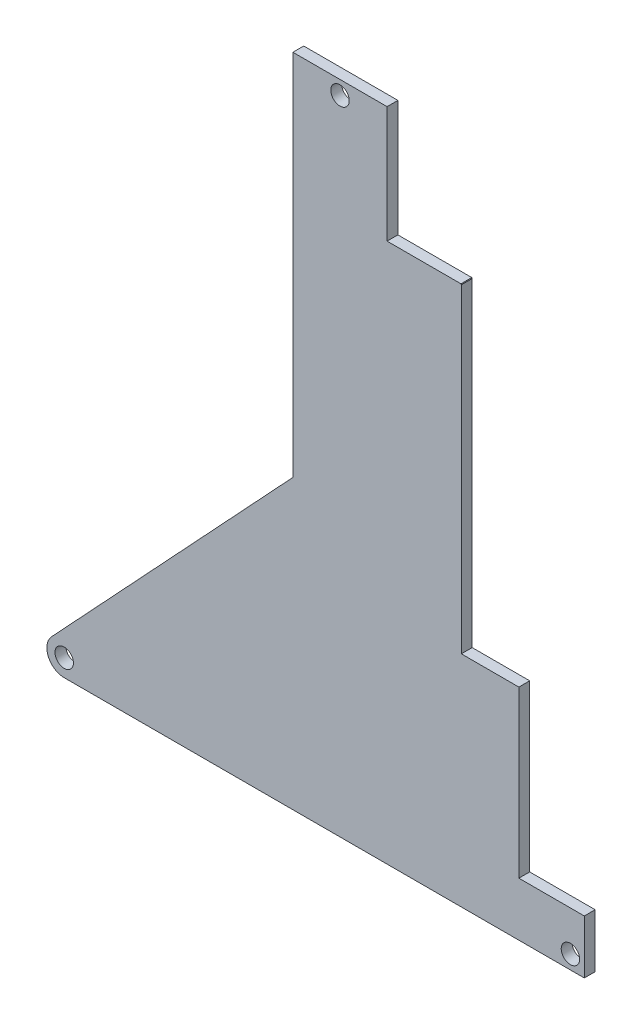
ISO-10303-21;
HEADER;
FILE_DESCRIPTION(('STEP AP214'),'2;1');
FILE_NAME('part.step','',(''),(''),'','','');
FILE_SCHEMA(('AUTOMOTIVE_DESIGN { 1 0 10303 214 1 1 1 1 }'));
ENDSEC;
DATA;
#1=APPLICATION_CONTEXT('core data for automotive mechanical design processes');
#2=APPLICATION_PROTOCOL_DEFINITION('international standard','automotive_design',2000,#1);
#3=PRODUCT_CONTEXT('',#1,'mechanical');
#4=PRODUCT('Part','Part','',(#3));
#5=PRODUCT_RELATED_PRODUCT_CATEGORY('part','',(#4));
#6=PRODUCT_DEFINITION_FORMATION('','',#4);
#7=PRODUCT_DEFINITION_CONTEXT('part definition',#1,'design');
#8=PRODUCT_DEFINITION('design','',#6,#7);
#9=PRODUCT_DEFINITION_SHAPE('','',#8);
#10=(LENGTH_UNIT() NAMED_UNIT(*) SI_UNIT(.MILLI.,.METRE.));
#11=(NAMED_UNIT(*) PLANE_ANGLE_UNIT() SI_UNIT($,.RADIAN.));
#12=(NAMED_UNIT(*) SI_UNIT($,.STERADIAN.) SOLID_ANGLE_UNIT());
#13=UNCERTAINTY_MEASURE_WITH_UNIT(LENGTH_MEASURE(1.E-05),#10,'distance_accuracy_value','');
#14=(GEOMETRIC_REPRESENTATION_CONTEXT(3) GLOBAL_UNCERTAINTY_ASSIGNED_CONTEXT((#13)) GLOBAL_UNIT_ASSIGNED_CONTEXT((#10,
#11,#12)) REPRESENTATION_CONTEXT('',''));
#15=CARTESIAN_POINT('',(0.,0.,0.));
#16=DIRECTION('',(0.,0.,1.));
#17=DIRECTION('',(1.,0.,0.));
#18=AXIS2_PLACEMENT_3D('',#15,#16,#17);
#19=CARTESIAN_POINT('',(-125.358525,-65.3471745152761,1.5875));
#20=DIRECTION('',(0.,0.,-1.));
#21=DIRECTION('',(-1.,0.,0.));
#22=AXIS2_PLACEMENT_3D('',#19,#20,#21);
#23=CYLINDRICAL_SURFACE('',#22,149.225);
#24=DIRECTION('',(0.,0.,-1.));
#25=VECTOR('',#24,1.);
#26=CARTESIAN_POINT('',(5.78929234933584,5.84517500000026,1.58750000000001));
#27=LINE('',#26,#25);
#28=CARTESIAN_POINT('',(5.78929234933584,5.84517500000026,1.58750000000001));
#29=VERTEX_POINT('',#28);
#30=CARTESIAN_POINT('',(5.78929234933584,5.84517500000026,0.));
#31=VERTEX_POINT('',#30);
#32=EDGE_CURVE('E145',#29,#31,#27,.T.);
#33=ORIENTED_EDGE('',*,*,#32,.F.);
#34=CARTESIAN_POINT('',(-125.358525,-65.3471745152761,1.5875));
#35=DIRECTION('',(0.,0.,1.));
#36=DIRECTION('',(1.,0.,0.));
#37=AXIS2_PLACEMENT_3D('',#34,#35,#36);
#38=CIRCLE('',#37,149.225);
#39=CARTESIAN_POINT('',(5.84517499999993,5.74213362110995,1.58750000000002));
#40=VERTEX_POINT('',#39);
#41=EDGE_CURVE('E151',#40,#29,#38,.T.);
#42=ORIENTED_EDGE('',*,*,#41,.F.);
#43=DIRECTION('',(0.,0.,-1.));
#44=VECTOR('',#43,1.);
#45=CARTESIAN_POINT('',(5.84517499999993,5.74213362110995,1.58750000000002));
#46=LINE('',#45,#44);
#47=CARTESIAN_POINT('',(5.84517499999993,5.74213362110995,0.));
#48=VERTEX_POINT('',#47);
#49=EDGE_CURVE('E179',#40,#48,#46,.T.);
#50=ORIENTED_EDGE('',*,*,#49,.T.);
#51=CARTESIAN_POINT('',(-125.358525,-65.3471745152761,0.));
#52=DIRECTION('',(0.,0.,1.));
#53=DIRECTION('',(1.,0.,0.));
#54=AXIS2_PLACEMENT_3D('',#51,#52,#53);
#55=CIRCLE('',#54,149.225);
#56=EDGE_CURVE('E209',#48,#31,#55,.T.);
#57=ORIENTED_EDGE('',*,*,#56,.T.);
#58=EDGE_LOOP('',(#33,#42,#50,#57));
#59=FACE_BOUND('',#58,.T.);
#60=ADVANCED_FACE('F36',(#59),#23,.T.);
#61=CARTESIAN_POINT('',(-125.358525,-65.3471745152761,1.5875));
#62=DIRECTION('',(0.,0.,1.));
#63=DIRECTION('',(1.,0.,0.));
#64=AXIS2_PLACEMENT_3D('',#61,#62,#63);
#65=PLANE('',#64);
#66=CARTESIAN_POINT('',(21.8344750000002,-71.1891745152759,1.5875));
#67=DIRECTION('',(0.,0.,-1.));
#68=DIRECTION('',(-1.,0.,0.));
#69=AXIS2_PLACEMENT_3D('',#66,#67,#68);
#70=CIRCLE('',#69,1.35255);
#71=CARTESIAN_POINT('',(20.4819250000002,-71.1891745152759,1.5875));
#72=VERTEX_POINT('',#71);
#73=EDGE_CURVE('E190',#72,#72,#70,.T.);
#74=ORIENTED_EDGE('',*,*,#73,.T.);
#75=EDGE_LOOP('',(#74));
#76=FACE_BOUND('',#75,.T.);
#77=CARTESIAN_POINT('',(-52.355372399303,-70.6811745152759,1.58750000000002));
#78=DIRECTION('',(0.,0.,-1.));
#79=DIRECTION('',(-1.,0.,0.));
#80=AXIS2_PLACEMENT_3D('',#77,#78,#79);
#81=CIRCLE('',#80,1.35255);
#82=CARTESIAN_POINT('',(-53.707922399303,-70.6811745152759,1.58750000000002));
#83=VERTEX_POINT('',#82);
#84=EDGE_CURVE('E196',#83,#83,#81,.T.);
#85=ORIENTED_EDGE('',*,*,#84,.T.);
#86=EDGE_LOOP('',(#85));
#87=FACE_BOUND('',#86,.T.);
#88=CARTESIAN_POINT('',(-11.9368860457787,20.8858254847239,1.58750000000001));
#89=DIRECTION('',(0.,0.,-1.));
#90=DIRECTION('',(-1.,0.,0.));
#91=AXIS2_PLACEMENT_3D('',#88,#89,#90);
#92=CIRCLE('',#91,1.35255);
#93=CARTESIAN_POINT('',(-13.2894360457787,20.8858254847239,1.58750000000001));
#94=VERTEX_POINT('',#93);
#95=EDGE_CURVE('E202',#94,#94,#92,.T.);
#96=ORIENTED_EDGE('',*,*,#95,.T.);
#97=EDGE_LOOP('',(#96));
#98=FACE_BOUND('',#97,.T.);
#99=ORIENTED_EDGE('',*,*,#41,.T.);
#100=DIRECTION('',(1.,0.,0.));
#101=VECTOR('',#100,1.);
#102=CARTESIAN_POINT('',(0.,5.84517500000026,1.5875));
#103=LINE('',#102,#101);
#104=CARTESIAN_POINT('',(-5.03649709155751,5.84517500000026,1.58750000000002));
#105=VERTEX_POINT('',#104);
#106=EDGE_CURVE('E141',#105,#29,#103,.T.);
#107=ORIENTED_EDGE('',*,*,#106,.F.);
#108=DIRECTION('',(0.,-1.,0.));
#109=VECTOR('',#108,1.);
#110=CARTESIAN_POINT('',(-5.03649709155752,0.,1.5875));
#111=LINE('',#110,#109);
#112=CARTESIAN_POINT('',(-5.03649709155759,22.917825484724,1.58750000000002));
#113=VERTEX_POINT('',#112);
#114=EDGE_CURVE('E131',#113,#105,#111,.T.);
#115=ORIENTED_EDGE('',*,*,#114,.F.);
#116=DIRECTION('',(-1.,0.,0.));
#117=VECTOR('',#116,1.);
#118=CARTESIAN_POINT('',(-18.8372749999999,22.9178254847239,1.58750000000003));
#119=LINE('',#118,#117);
#120=CARTESIAN_POINT('',(-18.8372749999999,22.9178254847239,1.58750000000003));
#121=VERTEX_POINT('',#120);
#122=EDGE_CURVE('E206',#113,#121,#119,.T.);
#123=ORIENTED_EDGE('',*,*,#122,.T.);
#124=DIRECTION('',(0.,-1.,0.));
#125=VECTOR('',#124,1.);
#126=CARTESIAN_POINT('',(-18.8372749999999,22.9178254847239,1.58750000000003));
#127=LINE('',#126,#125);
#128=CARTESIAN_POINT('',(-18.8372749999999,-31.0384526299173,1.58750000000002));
#129=VERTEX_POINT('',#128);
#130=EDGE_CURVE('E208',#121,#129,#127,.T.);
#131=ORIENTED_EDGE('',*,*,#130,.T.);
#132=DIRECTION('',(-0.682242521066146,-0.731125941578678,0.));
#133=VECTOR('',#132,1.);
#134=CARTESIAN_POINT('',(-30.5784249999998,-43.6208688292942,1.58750000000001));
#135=LINE('',#134,#133);
#136=CARTESIAN_POINT('',(-54.2124322909127,-68.9482785117678,1.5875));
#137=VERTEX_POINT('',#136);
#138=EDGE_CURVE('E211',#129,#137,#135,.T.);
#139=ORIENTED_EDGE('',*,*,#138,.T.);
#140=CARTESIAN_POINT('',(-52.355372399303,-70.6811745152759,1.58750000000002));
#141=DIRECTION('',(0.,0.,1.));
#142=DIRECTION('',(-1.,0.,0.));
#143=AXIS2_PLACEMENT_3D('',#140,#141,#142);
#144=CIRCLE('',#143,2.54);
#145=CARTESIAN_POINT('',(-52.3553723993029,-73.2211745152759,1.58750000000002));
#146=VERTEX_POINT('',#145);
#147=EDGE_CURVE('E213',#137,#146,#144,.T.);
#148=ORIENTED_EDGE('',*,*,#147,.T.);
#149=DIRECTION('',(1.,0.,0.));
#150=VECTOR('',#149,1.);
#151=CARTESIAN_POINT('',(-30.5784249999998,-73.2211745152759,1.58750000000001));
#152=LINE('',#151,#150);
#153=CARTESIAN_POINT('',(23.8664750000002,-73.2211745152759,1.58750000000001));
#154=VERTEX_POINT('',#153);
#155=EDGE_CURVE('E215',#146,#154,#152,.T.);
#156=ORIENTED_EDGE('',*,*,#155,.T.);
#157=DIRECTION('',(0.,1.,0.));
#158=VECTOR('',#157,1.);
#159=CARTESIAN_POINT('',(23.8664750000002,-65.3471745152757,1.58750000000002));
#160=LINE('',#159,#158);
#161=CARTESIAN_POINT('',(23.8664750000002,-65.3471745152757,1.58750000000002));
#162=VERTEX_POINT('',#161);
#163=EDGE_CURVE('E217',#154,#162,#160,.T.);
#164=ORIENTED_EDGE('',*,*,#163,.T.);
#165=DIRECTION('',(-1.,0.,0.));
#166=VECTOR('',#165,1.);
#167=CARTESIAN_POINT('',(2.26901830657766E-12,-65.3471745152765,1.5875));
#168=LINE('',#167,#166);
#169=CARTESIAN_POINT('',(14.277975,-65.3471745152761,1.5875));
#170=VERTEX_POINT('',#169);
#171=EDGE_CURVE('E158',#162,#170,#168,.T.);
#172=ORIENTED_EDGE('',*,*,#171,.T.);
#173=DIRECTION('',(0.,1.,0.));
#174=VECTOR('',#173,1.);
#175=CARTESIAN_POINT('',(14.277975,0.,1.5875));
#176=LINE('',#175,#174);
#177=CARTESIAN_POINT('',(14.277975,-41.0901745152762,1.58750000000003));
#178=VERTEX_POINT('',#177);
#179=EDGE_CURVE('E161',#170,#178,#176,.T.);
#180=ORIENTED_EDGE('',*,*,#179,.T.);
#181=DIRECTION('',(1.,0.,0.));
#182=VECTOR('',#181,1.);
#183=CARTESIAN_POINT('',(0.,-41.0901745152762,1.58750000000004));
#184=LINE('',#183,#182);
#185=CARTESIAN_POINT('',(5.84517499999992,-41.0901745152762,1.58750000000002));
#186=VERTEX_POINT('',#185);
#187=EDGE_CURVE('E165',#186,#178,#184,.T.);
#188=ORIENTED_EDGE('',*,*,#187,.F.);
#189=DIRECTION('',(0.,-1.,0.));
#190=VECTOR('',#189,1.);
#191=CARTESIAN_POINT('',(5.84517499999992,0.,1.58750000000001));
#192=LINE('',#191,#190);
#193=EDGE_CURVE('E167',#40,#186,#192,.T.);
#194=ORIENTED_EDGE('',*,*,#193,.F.);
#195=EDGE_LOOP('',(#99,#107,#115,#123,#131,#139,#148,#156,#164,#172,#180,#188,#194));
#196=FACE_BOUND('',#195,.T.);
#197=ADVANCED_FACE('F148',(#76,#87,#98,#196),#65,.T.);
#198=CARTESIAN_POINT('',(-125.358525,-65.3471745152761,0.));
#199=DIRECTION('',(0.,0.,1.));
#200=DIRECTION('',(1.,0.,0.));
#201=AXIS2_PLACEMENT_3D('',#198,#199,#200);
#202=PLANE('',#201);
#203=CARTESIAN_POINT('',(-11.9368860457787,20.8858254847239,0.));
#204=DIRECTION('',(0.,0.,-1.));
#205=DIRECTION('',(-1.,0.,0.));
#206=AXIS2_PLACEMENT_3D('',#203,#204,#205);
#207=CIRCLE('',#206,1.35255);
#208=CARTESIAN_POINT('',(-13.2894360457787,20.8858254847239,0.));
#209=VERTEX_POINT('',#208);
#210=EDGE_CURVE('E199',#209,#209,#207,.T.);
#211=ORIENTED_EDGE('',*,*,#210,.F.);
#212=EDGE_LOOP('',(#211));
#213=FACE_BOUND('',#212,.T.);
#214=CARTESIAN_POINT('',(-52.355372399303,-70.6811745152759,0.));
#215=DIRECTION('',(0.,0.,-1.));
#216=DIRECTION('',(-1.,0.,0.));
#217=AXIS2_PLACEMENT_3D('',#214,#215,#216);
#218=CIRCLE('',#217,1.35255);
#219=CARTESIAN_POINT('',(-53.707922399303,-70.6811745152759,0.));
#220=VERTEX_POINT('',#219);
#221=EDGE_CURVE('E193',#220,#220,#218,.T.);
#222=ORIENTED_EDGE('',*,*,#221,.F.);
#223=EDGE_LOOP('',(#222));
#224=FACE_BOUND('',#223,.T.);
#225=CARTESIAN_POINT('',(21.8344750000002,-71.1891745152759,0.));
#226=DIRECTION('',(0.,0.,-1.));
#227=DIRECTION('',(-1.,0.,0.));
#228=AXIS2_PLACEMENT_3D('',#225,#226,#227);
#229=CIRCLE('',#228,1.35255);
#230=CARTESIAN_POINT('',(20.4819250000002,-71.1891745152759,0.));
#231=VERTEX_POINT('',#230);
#232=EDGE_CURVE('E182',#231,#231,#229,.T.);
#233=ORIENTED_EDGE('',*,*,#232,.F.);
#234=EDGE_LOOP('',(#233));
#235=FACE_BOUND('',#234,.T.);
#236=DIRECTION('',(1.,0.,0.));
#237=VECTOR('',#236,1.);
#238=CARTESIAN_POINT('',(0.,5.84517500000026,0.));
#239=LINE('',#238,#237);
#240=CARTESIAN_POINT('',(-5.03649709155751,5.84517500000026,0.));
#241=VERTEX_POINT('',#240);
#242=EDGE_CURVE('E51',#241,#31,#239,.T.);
#243=ORIENTED_EDGE('',*,*,#242,.T.);
#244=ORIENTED_EDGE('',*,*,#56,.F.);
#245=DIRECTION('',(0.,-1.,0.));
#246=VECTOR('',#245,1.);
#247=CARTESIAN_POINT('',(5.84517499999992,0.,0.));
#248=LINE('',#247,#246);
#249=CARTESIAN_POINT('',(5.84517499999992,-41.0901745152762,0.));
#250=VERTEX_POINT('',#249);
#251=EDGE_CURVE('E162',#48,#250,#248,.T.);
#252=ORIENTED_EDGE('',*,*,#251,.T.);
#253=DIRECTION('',(1.,0.,0.));
#254=VECTOR('',#253,1.);
#255=CARTESIAN_POINT('',(0.,-41.0901745152762,0.));
#256=LINE('',#255,#254);
#257=CARTESIAN_POINT('',(14.277975,-41.0901745152762,0.));
#258=VERTEX_POINT('',#257);
#259=EDGE_CURVE('E174',#250,#258,#256,.T.);
#260=ORIENTED_EDGE('',*,*,#259,.T.);
#261=DIRECTION('',(0.,1.,0.));
#262=VECTOR('',#261,1.);
#263=CARTESIAN_POINT('',(14.277975,0.,0.));
#264=LINE('',#263,#262);
#265=CARTESIAN_POINT('',(14.277975,-65.3471745152761,0.));
#266=VERTEX_POINT('',#265);
#267=EDGE_CURVE('E171',#266,#258,#264,.T.);
#268=ORIENTED_EDGE('',*,*,#267,.F.);
#269=DIRECTION('',(-1.,0.,0.));
#270=VECTOR('',#269,1.);
#271=CARTESIAN_POINT('',(2.26901830657766E-12,-65.3471745152765,0.));
#272=LINE('',#271,#270);
#273=CARTESIAN_POINT('',(23.8664750000002,-65.3471745152757,0.));
#274=VERTEX_POINT('',#273);
#275=EDGE_CURVE('E59',#274,#266,#272,.T.);
#276=ORIENTED_EDGE('',*,*,#275,.F.);
#277=DIRECTION('',(0.,1.,0.));
#278=VECTOR('',#277,1.);
#279=CARTESIAN_POINT('',(23.8664750000002,-65.3471745152757,0.));
#280=LINE('',#279,#278);
#281=CARTESIAN_POINT('',(23.8664750000002,-73.2211745152759,0.));
#282=VERTEX_POINT('',#281);
#283=EDGE_CURVE('E233',#282,#274,#280,.T.);
#284=ORIENTED_EDGE('',*,*,#283,.F.);
#285=DIRECTION('',(1.,0.,0.));
#286=VECTOR('',#285,1.);
#287=CARTESIAN_POINT('',(23.8664750000002,-73.2211745152759,0.));
#288=LINE('',#287,#286);
#289=CARTESIAN_POINT('',(-52.3553723993029,-73.2211745152759,0.));
#290=VERTEX_POINT('',#289);
#291=EDGE_CURVE('E231',#290,#282,#288,.T.);
#292=ORIENTED_EDGE('',*,*,#291,.F.);
#293=CARTESIAN_POINT('',(-52.355372399303,-70.6811745152759,0.));
#294=DIRECTION('',(0.,0.,1.));
#295=DIRECTION('',(-1.,0.,0.));
#296=AXIS2_PLACEMENT_3D('',#293,#294,#295);
#297=CIRCLE('',#296,2.54);
#298=CARTESIAN_POINT('',(-54.2124322909127,-68.9482785117678,0.));
#299=VERTEX_POINT('',#298);
#300=EDGE_CURVE('E228',#299,#290,#297,.T.);
#301=ORIENTED_EDGE('',*,*,#300,.F.);
#302=DIRECTION('',(-0.682242521066146,-0.731125941578678,0.));
#303=VECTOR('',#302,1.);
#304=CARTESIAN_POINT('',(-54.2124322909127,-68.9482785117678,0.));
#305=LINE('',#304,#303);
#306=CARTESIAN_POINT('',(-18.8372749999999,-31.0384526299173,0.));
#307=VERTEX_POINT('',#306);
#308=EDGE_CURVE('E226',#307,#299,#305,.T.);
#309=ORIENTED_EDGE('',*,*,#308,.F.);
#310=DIRECTION('',(0.,-1.,0.));
#311=VECTOR('',#310,1.);
#312=CARTESIAN_POINT('',(-18.8372749999999,15.0967482425303,0.));
#313=LINE('',#312,#311);
#314=CARTESIAN_POINT('',(-18.8372749999999,22.9178254847239,0.));
#315=VERTEX_POINT('',#314);
#316=EDGE_CURVE('E223',#315,#307,#313,.T.);
#317=ORIENTED_EDGE('',*,*,#316,.F.);
#318=DIRECTION('',(-1.,0.,0.));
#319=VECTOR('',#318,1.);
#320=CARTESIAN_POINT('',(-18.8372749999999,22.9178254847239,0.));
#321=LINE('',#320,#319);
#322=CARTESIAN_POINT('',(-5.03649709155759,22.917825484724,0.));
#323=VERTEX_POINT('',#322);
#324=EDGE_CURVE('E205',#323,#315,#321,.T.);
#325=ORIENTED_EDGE('',*,*,#324,.F.);
#326=DIRECTION('',(0.,-1.,0.));
#327=VECTOR('',#326,1.);
#328=CARTESIAN_POINT('',(-5.03649709155752,0.,0.));
#329=LINE('',#328,#327);
#330=EDGE_CURVE('E152',#323,#241,#329,.T.);
#331=ORIENTED_EDGE('',*,*,#330,.T.);
#332=EDGE_LOOP('',(#243,#244,#252,#260,#268,#276,#284,#292,#301,#309,#317,#325,#331));
#333=FACE_BOUND('',#332,.T.);
#334=ADVANCED_FACE('F260',(#213,#224,#235,#333),#202,.F.);
#335=CARTESIAN_POINT('',(-18.8372749999999,22.9178254847239,1.58750000000003));
#336=DIRECTION('',(0.,-1.,0.));
#337=DIRECTION('',(1.,0.,0.));
#338=AXIS2_PLACEMENT_3D('',#335,#336,#337);
#339=PLANE('',#338);
#340=ORIENTED_EDGE('',*,*,#324,.T.);
#341=DIRECTION('',(0.,0.,-1.));
#342=VECTOR('',#341,1.);
#343=CARTESIAN_POINT('',(-18.8372749999999,22.9178254847239,1.58750000000003));
#344=LINE('',#343,#342);
#345=EDGE_CURVE('E11',#121,#315,#344,.T.);
#346=ORIENTED_EDGE('',*,*,#345,.F.);
#347=ORIENTED_EDGE('',*,*,#122,.F.);
#348=DIRECTION('',(0.,0.,-1.));
#349=VECTOR('',#348,1.);
#350=CARTESIAN_POINT('',(-5.03649709155752,22.9178254847239,1.58750000000002));
#351=LINE('',#350,#349);
#352=EDGE_CURVE('E136',#113,#323,#351,.T.);
#353=ORIENTED_EDGE('',*,*,#352,.T.);
#354=EDGE_LOOP('',(#340,#346,#347,#353));
#355=FACE_BOUND('',#354,.T.);
#356=ADVANCED_FACE('F38',(#355),#339,.F.);
#357=CARTESIAN_POINT('',(-18.8372749999999,15.0967482425303,1.5875));
#358=DIRECTION('',(1.,0.,0.));
#359=DIRECTION('',(0.,1.,0.));
#360=AXIS2_PLACEMENT_3D('',#357,#358,#359);
#361=PLANE('',#360);
#362=ORIENTED_EDGE('',*,*,#316,.T.);
#363=DIRECTION('',(0.,0.,-1.));
#364=VECTOR('',#363,1.);
#365=CARTESIAN_POINT('',(-18.8372749999999,-31.0384526299173,1.58750000000002));
#366=LINE('',#365,#364);
#367=EDGE_CURVE('E44',#129,#307,#366,.T.);
#368=ORIENTED_EDGE('',*,*,#367,.F.);
#369=ORIENTED_EDGE('',*,*,#130,.F.);
#370=ORIENTED_EDGE('',*,*,#345,.T.);
#371=EDGE_LOOP('',(#362,#368,#369,#370));
#372=FACE_BOUND('',#371,.T.);
#373=ADVANCED_FACE('F256',(#372),#361,.F.);
#374=CARTESIAN_POINT('',(-54.2124322909127,-68.9482785117678,1.5875));
#375=DIRECTION('',(0.731125941578678,-0.682242521066146,0.));
#376=DIRECTION('',(0.682242521066146,0.731125941578678,0.));
#377=AXIS2_PLACEMENT_3D('',#374,#375,#376);
#378=PLANE('',#377);
#379=ORIENTED_EDGE('',*,*,#308,.T.);
#380=DIRECTION('',(0.,0.,-1.));
#381=VECTOR('',#380,1.);
#382=CARTESIAN_POINT('',(-54.2124322909127,-68.9482785117678,1.5875));
#383=LINE('',#382,#381);
#384=EDGE_CURVE('E247',#137,#299,#383,.T.);
#385=ORIENTED_EDGE('',*,*,#384,.F.);
#386=ORIENTED_EDGE('',*,*,#138,.F.);
#387=ORIENTED_EDGE('',*,*,#367,.T.);
#388=EDGE_LOOP('',(#379,#385,#386,#387));
#389=FACE_BOUND('',#388,.T.);
#390=ADVANCED_FACE('F253',(#389),#378,.F.);
#391=CARTESIAN_POINT('',(-52.355372399303,-70.6811745152759,1.58750000000002));
#392=DIRECTION('',(0.,0.,-1.));
#393=DIRECTION('',(-1.,0.,0.));
#394=AXIS2_PLACEMENT_3D('',#391,#392,#393);
#395=CYLINDRICAL_SURFACE('',#394,2.54);
#396=ORIENTED_EDGE('',*,*,#300,.T.);
#397=DIRECTION('',(0.,0.,-1.));
#398=VECTOR('',#397,1.);
#399=CARTESIAN_POINT('',(-52.3553723993029,-73.2211745152759,1.58750000000002));
#400=LINE('',#399,#398);
#401=EDGE_CURVE('E244',#146,#290,#400,.T.);
#402=ORIENTED_EDGE('',*,*,#401,.F.);
#403=ORIENTED_EDGE('',*,*,#147,.F.);
#404=ORIENTED_EDGE('',*,*,#384,.T.);
#405=EDGE_LOOP('',(#396,#402,#403,#404));
#406=FACE_BOUND('',#405,.T.);
#407=ADVANCED_FACE('F265',(#406),#395,.T.);
#408=CARTESIAN_POINT('',(23.8664750000002,-73.2211745152759,1.58750000000001));
#409=DIRECTION('',(0.,1.,0.));
#410=DIRECTION('',(0.,0.,1.));
#411=AXIS2_PLACEMENT_3D('',#408,#409,#410);
#412=PLANE('',#411);
#413=ORIENTED_EDGE('',*,*,#291,.T.);
#414=DIRECTION('',(0.,0.,-1.));
#415=VECTOR('',#414,1.);
#416=CARTESIAN_POINT('',(23.8664750000002,-73.2211745152759,1.58750000000001));
#417=LINE('',#416,#415);
#418=EDGE_CURVE('E241',#154,#282,#417,.T.);
#419=ORIENTED_EDGE('',*,*,#418,.F.);
#420=ORIENTED_EDGE('',*,*,#155,.F.);
#421=ORIENTED_EDGE('',*,*,#401,.T.);
#422=EDGE_LOOP('',(#413,#419,#420,#421));
#423=FACE_BOUND('',#422,.T.);
#424=ADVANCED_FACE('F269',(#423),#412,.F.);
#425=CARTESIAN_POINT('',(23.8664750000002,-65.3471745152757,1.58750000000002));
#426=DIRECTION('',(-1.,0.,0.));
#427=DIRECTION('',(0.,0.,1.));
#428=AXIS2_PLACEMENT_3D('',#425,#426,#427);
#429=PLANE('',#428);
#430=ORIENTED_EDGE('',*,*,#283,.T.);
#431=DIRECTION('',(0.,0.,-1.));
#432=VECTOR('',#431,1.);
#433=CARTESIAN_POINT('',(23.8664750000002,-65.3471745152757,1.58750000000002));
#434=LINE('',#433,#432);
#435=EDGE_CURVE('E239',#162,#274,#434,.T.);
#436=ORIENTED_EDGE('',*,*,#435,.F.);
#437=ORIENTED_EDGE('',*,*,#163,.F.);
#438=ORIENTED_EDGE('',*,*,#418,.T.);
#439=EDGE_LOOP('',(#430,#436,#437,#438));
#440=FACE_BOUND('',#439,.T.);
#441=ADVANCED_FACE('F290',(#440),#429,.F.);
#442=CARTESIAN_POINT('',(-11.9368860457787,20.8858254847239,0.));
#443=DIRECTION('',(0.,0.,-1.));
#444=DIRECTION('',(-1.,0.,0.));
#445=AXIS2_PLACEMENT_3D('',#442,#443,#444);
#446=CYLINDRICAL_SURFACE('',#445,1.35255);
#447=ORIENTED_EDGE('',*,*,#95,.F.);
#448=EDGE_LOOP('',(#447));
#449=FACE_BOUND('',#448,.T.);
#450=ORIENTED_EDGE('',*,*,#210,.T.);
#451=EDGE_LOOP('',(#450));
#452=FACE_BOUND('',#451,.T.);
#453=ADVANCED_FACE('F293',(#449,#452),#446,.F.);
#454=CARTESIAN_POINT('',(-52.355372399303,-70.6811745152759,0.));
#455=DIRECTION('',(0.,0.,-1.));
#456=DIRECTION('',(-1.,0.,0.));
#457=AXIS2_PLACEMENT_3D('',#454,#455,#456);
#458=CYLINDRICAL_SURFACE('',#457,1.35255);
#459=ORIENTED_EDGE('',*,*,#84,.F.);
#460=EDGE_LOOP('',(#459));
#461=FACE_BOUND('',#460,.T.);
#462=ORIENTED_EDGE('',*,*,#221,.T.);
#463=EDGE_LOOP('',(#462));
#464=FACE_BOUND('',#463,.T.);
#465=ADVANCED_FACE('F324',(#461,#464),#458,.F.);
#466=CARTESIAN_POINT('',(21.8344750000002,-71.1891745152759,0.));
#467=DIRECTION('',(0.,0.,-1.));
#468=DIRECTION('',(-1.,0.,0.));
#469=AXIS2_PLACEMENT_3D('',#466,#467,#468);
#470=CYLINDRICAL_SURFACE('',#469,1.35255);
#471=ORIENTED_EDGE('',*,*,#73,.F.);
#472=EDGE_LOOP('',(#471));
#473=FACE_BOUND('',#472,.T.);
#474=ORIENTED_EDGE('',*,*,#232,.T.);
#475=EDGE_LOOP('',(#474));
#476=FACE_BOUND('',#475,.T.);
#477=ADVANCED_FACE('F332',(#473,#476),#470,.F.);
#478=CARTESIAN_POINT('',(2.26901830657766E-12,-65.3471745152765,1.5875));
#479=DIRECTION('',(0.,-1.,0.));
#480=DIRECTION('',(1.,0.,0.));
#481=AXIS2_PLACEMENT_3D('',#478,#479,#480);
#482=PLANE('',#481);
#483=ORIENTED_EDGE('',*,*,#275,.T.);
#484=DIRECTION('',(0.,0.,-1.));
#485=VECTOR('',#484,1.);
#486=CARTESIAN_POINT('',(14.277975,-65.3471745152761,1.5875));
#487=LINE('',#486,#485);
#488=EDGE_CURVE('E169',#170,#266,#487,.T.);
#489=ORIENTED_EDGE('',*,*,#488,.F.);
#490=ORIENTED_EDGE('',*,*,#171,.F.);
#491=ORIENTED_EDGE('',*,*,#435,.T.);
#492=EDGE_LOOP('',(#483,#489,#490,#491));
#493=FACE_BOUND('',#492,.T.);
#494=ADVANCED_FACE('F340',(#493),#482,.F.);
#495=CARTESIAN_POINT('',(5.84517499999992,0.,1.58750000000001));
#496=DIRECTION('',(1.,0.,0.));
#497=DIRECTION('',(0.,1.,0.));
#498=AXIS2_PLACEMENT_3D('',#495,#496,#497);
#499=PLANE('',#498);
#500=ORIENTED_EDGE('',*,*,#251,.F.);
#501=ORIENTED_EDGE('',*,*,#49,.F.);
#502=ORIENTED_EDGE('',*,*,#193,.T.);
#503=DIRECTION('',(0.,0.,-1.));
#504=VECTOR('',#503,1.);
#505=CARTESIAN_POINT('',(5.84517499999992,-41.0901745152762,1.58750000000002));
#506=LINE('',#505,#504);
#507=EDGE_CURVE('E183',#186,#250,#506,.T.);
#508=ORIENTED_EDGE('',*,*,#507,.T.);
#509=EDGE_LOOP('',(#500,#501,#502,#508));
#510=FACE_BOUND('',#509,.T.);
#511=ADVANCED_FACE('F349',(#510),#499,.T.);
#512=CARTESIAN_POINT('',(0.,-41.0901745152762,1.58750000000004));
#513=DIRECTION('',(0.,1.,0.));
#514=DIRECTION('',(0.,0.,1.));
#515=AXIS2_PLACEMENT_3D('',#512,#513,#514);
#516=PLANE('',#515);
#517=ORIENTED_EDGE('',*,*,#259,.F.);
#518=ORIENTED_EDGE('',*,*,#507,.F.);
#519=ORIENTED_EDGE('',*,*,#187,.T.);
#520=DIRECTION('',(0.,0.,-1.));
#521=VECTOR('',#520,1.);
#522=CARTESIAN_POINT('',(14.277975,-41.0901745152762,1.58750000000003));
#523=LINE('',#522,#521);
#524=EDGE_CURVE('E185',#178,#258,#523,.T.);
#525=ORIENTED_EDGE('',*,*,#524,.T.);
#526=EDGE_LOOP('',(#517,#518,#519,#525));
#527=FACE_BOUND('',#526,.T.);
#528=ADVANCED_FACE('F356',(#527),#516,.T.);
#529=CARTESIAN_POINT('',(14.277975,0.,1.5875));
#530=DIRECTION('',(-1.,0.,0.));
#531=DIRECTION('',(0.,0.,1.));
#532=AXIS2_PLACEMENT_3D('',#529,#530,#531);
#533=PLANE('',#532);
#534=ORIENTED_EDGE('',*,*,#267,.T.);
#535=ORIENTED_EDGE('',*,*,#524,.F.);
#536=ORIENTED_EDGE('',*,*,#179,.F.);
#537=ORIENTED_EDGE('',*,*,#488,.T.);
#538=EDGE_LOOP('',(#534,#535,#536,#537));
#539=FACE_BOUND('',#538,.T.);
#540=ADVANCED_FACE('F365',(#539),#533,.F.);
#541=CARTESIAN_POINT('',(0.,5.84517500000026,1.5875));
#542=DIRECTION('',(0.,1.,0.));
#543=DIRECTION('',(0.,0.,1.));
#544=AXIS2_PLACEMENT_3D('',#541,#542,#543);
#545=PLANE('',#544);
#546=ORIENTED_EDGE('',*,*,#242,.F.);
#547=DIRECTION('',(0.,0.,-1.));
#548=VECTOR('',#547,1.);
#549=CARTESIAN_POINT('',(-5.03649709155751,5.84517500000026,1.58750000000002));
#550=LINE('',#549,#548);
#551=EDGE_CURVE('E133',#105,#241,#550,.T.);
#552=ORIENTED_EDGE('',*,*,#551,.F.);
#553=ORIENTED_EDGE('',*,*,#106,.T.);
#554=ORIENTED_EDGE('',*,*,#32,.T.);
#555=EDGE_LOOP('',(#546,#552,#553,#554));
#556=FACE_BOUND('',#555,.T.);
#557=ADVANCED_FACE('F143',(#556),#545,.T.);
#558=CARTESIAN_POINT('',(-5.03649709155752,0.,1.5875));
#559=DIRECTION('',(1.,0.,0.));
#560=DIRECTION('',(0.,0.,-1.));
#561=AXIS2_PLACEMENT_3D('',#558,#559,#560);
#562=PLANE('',#561);
#563=ORIENTED_EDGE('',*,*,#330,.F.);
#564=ORIENTED_EDGE('',*,*,#352,.F.);
#565=ORIENTED_EDGE('',*,*,#114,.T.);
#566=ORIENTED_EDGE('',*,*,#551,.T.);
#567=EDGE_LOOP('',(#563,#564,#565,#566));
#568=FACE_BOUND('',#567,.T.);
#569=ADVANCED_FACE('F132',(#568),#562,.T.);
#570=CLOSED_SHELL('',(#60,#197,#334,#356,#373,#390,#407,#424,#441,#453,#465,#477,#494,#511,#528,
#540,#557,#569));
#571=MANIFOLD_SOLID_BREP('B2',#570);
#572=ADVANCED_BREP_SHAPE_REPRESENTATION('',(#18,#571),#14);
#573=SHAPE_DEFINITION_REPRESENTATION(#9,#572);
ENDSEC;
END-ISO-10303-21;
